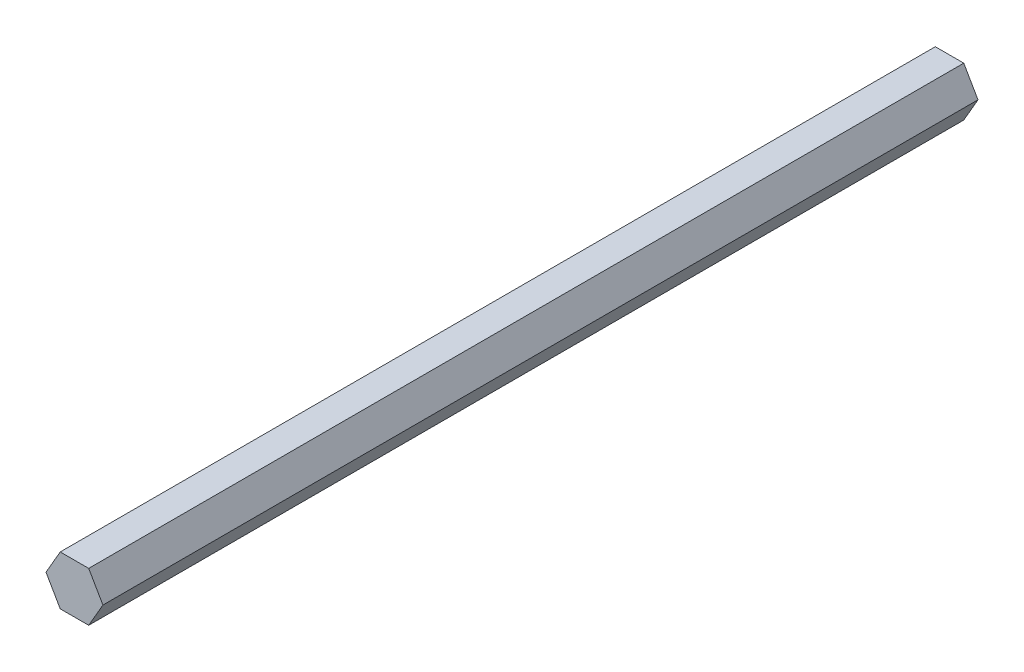
ISO-10303-21;
HEADER;
FILE_DESCRIPTION(('STEP AP214'),'2;1');
FILE_NAME('part.step','',(''),(''),'','','');
FILE_SCHEMA(('AUTOMOTIVE_DESIGN { 1 0 10303 214 1 1 1 1 }'));
ENDSEC;
DATA;
#1=APPLICATION_CONTEXT('core data for automotive mechanical design processes');
#2=APPLICATION_PROTOCOL_DEFINITION('international standard','automotive_design',2000,#1);
#3=PRODUCT_CONTEXT('',#1,'mechanical');
#4=PRODUCT('Part','Part','',(#3));
#5=PRODUCT_RELATED_PRODUCT_CATEGORY('part','',(#4));
#6=PRODUCT_DEFINITION_FORMATION('','',#4);
#7=PRODUCT_DEFINITION_CONTEXT('part definition',#1,'design');
#8=PRODUCT_DEFINITION('design','',#6,#7);
#9=PRODUCT_DEFINITION_SHAPE('','',#8);
#10=(LENGTH_UNIT() NAMED_UNIT(*) SI_UNIT(.MILLI.,.METRE.));
#11=(NAMED_UNIT(*) PLANE_ANGLE_UNIT() SI_UNIT($,.RADIAN.));
#12=(NAMED_UNIT(*) SI_UNIT($,.STERADIAN.) SOLID_ANGLE_UNIT());
#13=UNCERTAINTY_MEASURE_WITH_UNIT(LENGTH_MEASURE(1.E-05),#10,'distance_accuracy_value','');
#14=(GEOMETRIC_REPRESENTATION_CONTEXT(3) GLOBAL_UNCERTAINTY_ASSIGNED_CONTEXT((#13)) GLOBAL_UNIT_ASSIGNED_CONTEXT((#10,
#11,#12)) REPRESENTATION_CONTEXT('',''));
#15=CARTESIAN_POINT('',(0.,0.,0.));
#16=DIRECTION('',(0.,0.,1.));
#17=DIRECTION('',(1.,0.,0.));
#18=AXIS2_PLACEMENT_3D('',#15,#16,#17);
#19=CARTESIAN_POINT('',(-3.6661742093542,6.34999999999996,225.425));
#20=DIRECTION('',(0.866025403784441,-0.499999999999995,0.));
#21=DIRECTION('',(0.499999999999995,0.866025403784442,0.));
#22=AXIS2_PLACEMENT_3D('',#19,#20,#21);
#23=PLANE('',#22);
#24=DIRECTION('',(-0.499999999999995,-0.866025403784442,0.));
#25=VECTOR('',#24,1.);
#26=CARTESIAN_POINT('',(-3.6661742093542,6.34999999999996,0.));
#27=LINE('',#26,#25);
#28=CARTESIAN_POINT('',(-3.6661742093542,6.34999999999996,0.));
#29=VERTEX_POINT('',#28);
#30=CARTESIAN_POINT('',(-7.33234841870825,0.,0.));
#31=VERTEX_POINT('',#30);
#32=EDGE_CURVE('E117',#29,#31,#27,.T.);
#33=ORIENTED_EDGE('',*,*,#32,.T.);
#34=DIRECTION('',(0.,0.,-1.));
#35=VECTOR('',#34,1.);
#36=CARTESIAN_POINT('',(-7.33234841870825,0.,225.425));
#37=LINE('',#36,#35);
#38=CARTESIAN_POINT('',(-7.33234841870825,0.,225.425));
#39=VERTEX_POINT('',#38);
#40=EDGE_CURVE('E11',#39,#31,#37,.T.);
#41=ORIENTED_EDGE('',*,*,#40,.F.);
#42=DIRECTION('',(-0.499999999999995,-0.866025403784442,0.));
#43=VECTOR('',#42,1.);
#44=CARTESIAN_POINT('',(-3.6661742093542,6.34999999999996,225.425));
#45=LINE('',#44,#43);
#46=CARTESIAN_POINT('',(-3.6661742093542,6.34999999999996,225.425));
#47=VERTEX_POINT('',#46);
#48=EDGE_CURVE('E127',#47,#39,#45,.T.);
#49=ORIENTED_EDGE('',*,*,#48,.F.);
#50=DIRECTION('',(0.,0.,-1.));
#51=VECTOR('',#50,1.);
#52=CARTESIAN_POINT('',(-3.6661742093542,6.34999999999996,225.425));
#53=LINE('',#52,#51);
#54=EDGE_CURVE('E113',#47,#29,#53,.T.);
#55=ORIENTED_EDGE('',*,*,#54,.T.);
#56=EDGE_LOOP('',(#33,#41,#49,#55));
#57=FACE_BOUND('',#56,.T.);
#58=ADVANCED_FACE('F33',(#57),#23,.F.);
#59=CARTESIAN_POINT('',(-7.33234841870825,0.,225.425));
#60=DIRECTION('',(0.866025403784438,0.500000000000001,0.));
#61=DIRECTION('',(-0.500000000000001,0.866025403784438,0.));
#62=AXIS2_PLACEMENT_3D('',#59,#60,#61);
#63=PLANE('',#62);
#64=DIRECTION('',(0.500000000000001,-0.866025403784438,0.));
#65=VECTOR('',#64,1.);
#66=CARTESIAN_POINT('',(-7.33234841870825,0.,0.));
#67=LINE('',#66,#65);
#68=CARTESIAN_POINT('',(-3.66617420935411,-6.35000000000001,0.));
#69=VERTEX_POINT('',#68);
#70=EDGE_CURVE('E120',#31,#69,#67,.T.);
#71=ORIENTED_EDGE('',*,*,#70,.T.);
#72=DIRECTION('',(0.,0.,-1.));
#73=VECTOR('',#72,1.);
#74=CARTESIAN_POINT('',(-3.66617420935411,-6.35000000000001,225.425));
#75=LINE('',#74,#73);
#76=CARTESIAN_POINT('',(-3.66617420935411,-6.35000000000001,225.425));
#77=VERTEX_POINT('',#76);
#78=EDGE_CURVE('E41',#77,#69,#75,.T.);
#79=ORIENTED_EDGE('',*,*,#78,.F.);
#80=DIRECTION('',(0.500000000000001,-0.866025403784438,0.));
#81=VECTOR('',#80,1.);
#82=CARTESIAN_POINT('',(-7.33234841870825,0.,225.425));
#83=LINE('',#82,#81);
#84=EDGE_CURVE('E86',#39,#77,#83,.T.);
#85=ORIENTED_EDGE('',*,*,#84,.F.);
#86=ORIENTED_EDGE('',*,*,#40,.T.);
#87=EDGE_LOOP('',(#71,#79,#85,#86));
#88=FACE_BOUND('',#87,.T.);
#89=ADVANCED_FACE('F151',(#88),#63,.F.);
#90=CARTESIAN_POINT('',(-3.66617420935411,-6.35000000000001,225.425));
#91=DIRECTION('',(0.,1.,0.));
#92=DIRECTION('',(-1.,0.,0.));
#93=AXIS2_PLACEMENT_3D('',#90,#91,#92);
#94=PLANE('',#93);
#95=DIRECTION('',(1.,0.,0.));
#96=VECTOR('',#95,1.);
#97=CARTESIAN_POINT('',(-3.66617420935411,-6.35000000000001,0.));
#98=LINE('',#97,#96);
#99=CARTESIAN_POINT('',(3.66617420935416,-6.34999999999999,0.));
#100=VERTEX_POINT('',#99);
#101=EDGE_CURVE('E122',#69,#100,#98,.T.);
#102=ORIENTED_EDGE('',*,*,#101,.T.);
#103=DIRECTION('',(0.,0.,-1.));
#104=VECTOR('',#103,1.);
#105=CARTESIAN_POINT('',(3.66617420935416,-6.34999999999999,225.425));
#106=LINE('',#105,#104);
#107=CARTESIAN_POINT('',(3.66617420935416,-6.34999999999999,225.425));
#108=VERTEX_POINT('',#107);
#109=EDGE_CURVE('E108',#108,#100,#106,.T.);
#110=ORIENTED_EDGE('',*,*,#109,.F.);
#111=DIRECTION('',(1.,0.,0.));
#112=VECTOR('',#111,1.);
#113=CARTESIAN_POINT('',(-3.66617420935411,-6.35000000000001,225.425));
#114=LINE('',#113,#112);
#115=EDGE_CURVE('E99',#77,#108,#114,.T.);
#116=ORIENTED_EDGE('',*,*,#115,.F.);
#117=ORIENTED_EDGE('',*,*,#78,.T.);
#118=EDGE_LOOP('',(#102,#110,#116,#117));
#119=FACE_BOUND('',#118,.T.);
#120=ADVANCED_FACE('F133',(#119),#94,.F.);
#121=CARTESIAN_POINT('',(3.66617420935416,-6.34999999999999,225.425));
#122=DIRECTION('',(-0.866025403784442,0.499999999999995,0.));
#123=DIRECTION('',(-0.499999999999995,-0.866025403784442,0.));
#124=AXIS2_PLACEMENT_3D('',#121,#122,#123);
#125=PLANE('',#124);
#126=DIRECTION('',(0.499999999999995,0.866025403784442,0.));
#127=VECTOR('',#126,1.);
#128=CARTESIAN_POINT('',(3.66617420935416,-6.34999999999999,0.));
#129=LINE('',#128,#127);
#130=CARTESIAN_POINT('',(7.33234841870825,0.,0.));
#131=VERTEX_POINT('',#130);
#132=EDGE_CURVE('E107',#100,#131,#129,.T.);
#133=ORIENTED_EDGE('',*,*,#132,.T.);
#134=DIRECTION('',(0.,0.,-1.));
#135=VECTOR('',#134,1.);
#136=CARTESIAN_POINT('',(7.33234841870825,0.,225.425));
#137=LINE('',#136,#135);
#138=CARTESIAN_POINT('',(7.33234841870825,0.,225.425));
#139=VERTEX_POINT('',#138);
#140=EDGE_CURVE('E104',#139,#131,#137,.T.);
#141=ORIENTED_EDGE('',*,*,#140,.F.);
#142=DIRECTION('',(0.499999999999995,0.866025403784442,0.));
#143=VECTOR('',#142,1.);
#144=CARTESIAN_POINT('',(3.66617420935416,-6.34999999999999,225.425));
#145=LINE('',#144,#143);
#146=EDGE_CURVE('E93',#108,#139,#145,.T.);
#147=ORIENTED_EDGE('',*,*,#146,.F.);
#148=ORIENTED_EDGE('',*,*,#109,.T.);
#149=EDGE_LOOP('',(#133,#141,#147,#148));
#150=FACE_BOUND('',#149,.T.);
#151=ADVANCED_FACE('F105',(#150),#125,.F.);
#152=CARTESIAN_POINT('',(7.33234841870825,0.,225.425));
#153=DIRECTION('',(-0.866025403784435,-0.500000000000007,0.));
#154=DIRECTION('',(0.500000000000007,-0.866025403784435,0.));
#155=AXIS2_PLACEMENT_3D('',#152,#153,#154);
#156=PLANE('',#155);
#157=DIRECTION('',(-0.500000000000007,0.866025403784435,0.));
#158=VECTOR('',#157,1.);
#159=CARTESIAN_POINT('',(7.33234841870825,0.,0.));
#160=LINE('',#159,#158);
#161=CARTESIAN_POINT('',(3.66617420935407,6.35000000000004,0.));
#162=VERTEX_POINT('',#161);
#163=EDGE_CURVE('E72',#131,#162,#160,.T.);
#164=ORIENTED_EDGE('',*,*,#163,.T.);
#165=DIRECTION('',(0.,0.,-1.));
#166=VECTOR('',#165,1.);
#167=CARTESIAN_POINT('',(3.66617420935407,6.35000000000004,225.425));
#168=LINE('',#167,#166);
#169=CARTESIAN_POINT('',(3.66617420935407,6.35000000000004,225.425));
#170=VERTEX_POINT('',#169);
#171=EDGE_CURVE('E109',#170,#162,#168,.T.);
#172=ORIENTED_EDGE('',*,*,#171,.F.);
#173=DIRECTION('',(-0.500000000000007,0.866025403784435,0.));
#174=VECTOR('',#173,1.);
#175=CARTESIAN_POINT('',(7.33234841870825,0.,225.425));
#176=LINE('',#175,#174);
#177=EDGE_CURVE('E97',#139,#170,#176,.T.);
#178=ORIENTED_EDGE('',*,*,#177,.F.);
#179=ORIENTED_EDGE('',*,*,#140,.T.);
#180=EDGE_LOOP('',(#164,#172,#178,#179));
#181=FACE_BOUND('',#180,.T.);
#182=ADVANCED_FACE('F111',(#181),#156,.F.);
#183=CARTESIAN_POINT('',(3.66617420935407,6.35000000000004,225.425));
#184=DIRECTION('',(0.,-1.,0.));
#185=DIRECTION('',(1.,0.,0.));
#186=AXIS2_PLACEMENT_3D('',#183,#184,#185);
#187=PLANE('',#186);
#188=DIRECTION('',(-1.,0.,0.));
#189=VECTOR('',#188,1.);
#190=CARTESIAN_POINT('',(3.66617420935407,6.35000000000004,0.));
#191=LINE('',#190,#189);
#192=EDGE_CURVE('E78',#162,#29,#191,.T.);
#193=ORIENTED_EDGE('',*,*,#192,.T.);
#194=ORIENTED_EDGE('',*,*,#54,.F.);
#195=DIRECTION('',(-1.,0.,0.));
#196=VECTOR('',#195,1.);
#197=CARTESIAN_POINT('',(3.66617420935407,6.35000000000004,225.425));
#198=LINE('',#197,#196);
#199=EDGE_CURVE('E49',#170,#47,#198,.T.);
#200=ORIENTED_EDGE('',*,*,#199,.F.);
#201=ORIENTED_EDGE('',*,*,#171,.T.);
#202=EDGE_LOOP('',(#193,#194,#200,#201));
#203=FACE_BOUND('',#202,.T.);
#204=ADVANCED_FACE('F140',(#203),#187,.F.);
#205=CARTESIAN_POINT('',(0.,0.,225.425));
#206=DIRECTION('',(0.,0.,1.));
#207=DIRECTION('',(1.,0.,0.));
#208=AXIS2_PLACEMENT_3D('',#205,#206,#207);
#209=PLANE('',#208);
#210=ORIENTED_EDGE('',*,*,#48,.T.);
#211=ORIENTED_EDGE('',*,*,#84,.T.);
#212=ORIENTED_EDGE('',*,*,#115,.T.);
#213=ORIENTED_EDGE('',*,*,#146,.T.);
#214=ORIENTED_EDGE('',*,*,#177,.T.);
#215=ORIENTED_EDGE('',*,*,#199,.T.);
#216=EDGE_LOOP('',(#210,#211,#212,#213,#214,#215));
#217=FACE_BOUND('',#216,.T.);
#218=ADVANCED_FACE('F95',(#217),#209,.T.);
#219=CARTESIAN_POINT('',(0.,0.,0.));
#220=DIRECTION('',(0.,0.,1.));
#221=DIRECTION('',(1.,0.,0.));
#222=AXIS2_PLACEMENT_3D('',#219,#220,#221);
#223=PLANE('',#222);
#224=ORIENTED_EDGE('',*,*,#32,.F.);
#225=ORIENTED_EDGE('',*,*,#192,.F.);
#226=ORIENTED_EDGE('',*,*,#163,.F.);
#227=ORIENTED_EDGE('',*,*,#132,.F.);
#228=ORIENTED_EDGE('',*,*,#101,.F.);
#229=ORIENTED_EDGE('',*,*,#70,.F.);
#230=EDGE_LOOP('',(#224,#225,#226,#227,#228,#229));
#231=FACE_BOUND('',#230,.T.);
#232=ADVANCED_FACE('F136',(#231),#223,.F.);
#233=CLOSED_SHELL('',(#58,#89,#120,#151,#182,#204,#218,#232));
#234=MANIFOLD_SOLID_BREP('B2',#233);
#235=ADVANCED_BREP_SHAPE_REPRESENTATION('',(#18,#234),#14);
#236=SHAPE_DEFINITION_REPRESENTATION(#9,#235);
ENDSEC;
END-ISO-10303-21;
